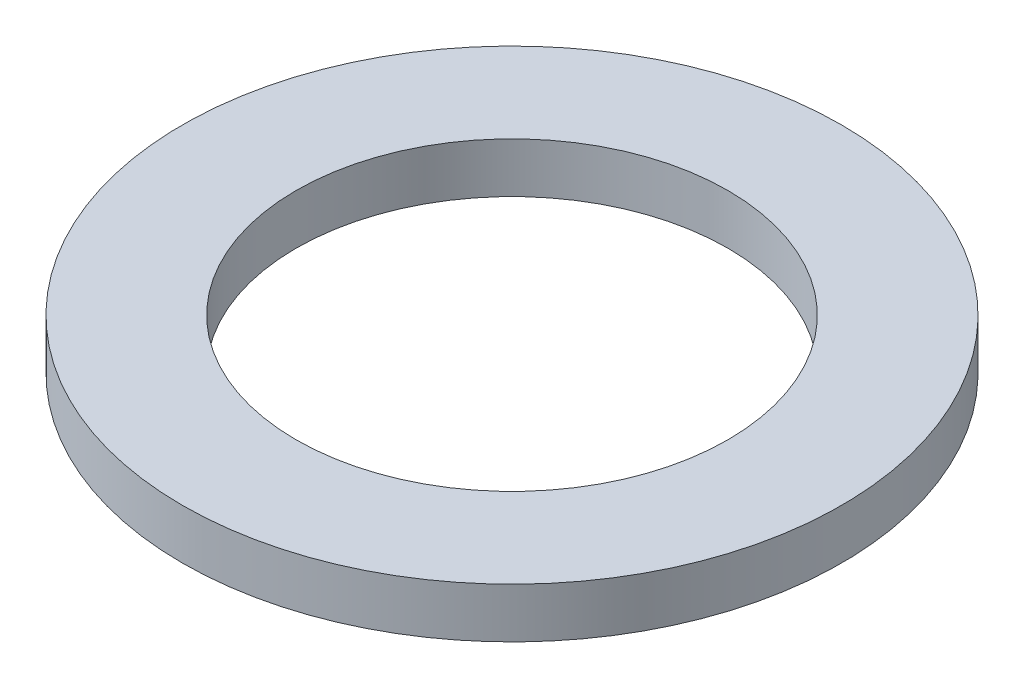
ISO-10303-21;
HEADER;
FILE_DESCRIPTION(('STEP AP214'),'2;1');
FILE_NAME('part.step','',(''),(''),'','','');
FILE_SCHEMA(('AUTOMOTIVE_DESIGN { 1 0 10303 214 1 1 1 1 }'));
ENDSEC;
DATA;
#1=APPLICATION_CONTEXT('core data for automotive mechanical design processes');
#2=APPLICATION_PROTOCOL_DEFINITION('international standard','automotive_design',2000,#1);
#3=PRODUCT_CONTEXT('',#1,'mechanical');
#4=PRODUCT('Part','Part','',(#3));
#5=PRODUCT_RELATED_PRODUCT_CATEGORY('part','',(#4));
#6=PRODUCT_DEFINITION_FORMATION('','',#4);
#7=PRODUCT_DEFINITION_CONTEXT('part definition',#1,'design');
#8=PRODUCT_DEFINITION('design','',#6,#7);
#9=PRODUCT_DEFINITION_SHAPE('','',#8);
#10=(LENGTH_UNIT() NAMED_UNIT(*) SI_UNIT(.MILLI.,.METRE.));
#11=(NAMED_UNIT(*) PLANE_ANGLE_UNIT() SI_UNIT($,.RADIAN.));
#12=(NAMED_UNIT(*) SI_UNIT($,.STERADIAN.) SOLID_ANGLE_UNIT());
#13=UNCERTAINTY_MEASURE_WITH_UNIT(LENGTH_MEASURE(1.E-05),#10,'distance_accuracy_value','');
#14=(GEOMETRIC_REPRESENTATION_CONTEXT(3) GLOBAL_UNCERTAINTY_ASSIGNED_CONTEXT((#13)) GLOBAL_UNIT_ASSIGNED_CONTEXT((#10,
#11,#12)) REPRESENTATION_CONTEXT('',''));
#15=CARTESIAN_POINT('',(0.,0.,0.));
#16=DIRECTION('',(0.,0.,1.));
#17=DIRECTION('',(1.,0.,0.));
#18=AXIS2_PLACEMENT_3D('',#15,#16,#17);
#19=CARTESIAN_POINT('',(0.,11.,0.));
#20=DIRECTION('',(0.,-1.,0.));
#21=DIRECTION('',(0.,0.,-1.));
#22=AXIS2_PLACEMENT_3D('',#19,#20,#21);
#23=CYLINDRICAL_SURFACE('',#22,72.5);
#24=CARTESIAN_POINT('',(0.,11.,0.));
#25=DIRECTION('',(0.,1.,0.));
#26=DIRECTION('',(0.,0.,1.));
#27=AXIS2_PLACEMENT_3D('',#24,#25,#26);
#28=CIRCLE('',#27,72.5);
#29=CARTESIAN_POINT('',(0.,11.,72.5));
#30=VERTEX_POINT('',#29);
#31=EDGE_CURVE('E10',#30,#30,#28,.T.);
#32=ORIENTED_EDGE('',*,*,#31,.F.);
#33=EDGE_LOOP('',(#32));
#34=FACE_BOUND('',#33,.T.);
#35=CARTESIAN_POINT('',(0.,0.,0.));
#36=DIRECTION('',(0.,1.,0.));
#37=DIRECTION('',(0.,0.,1.));
#38=AXIS2_PLACEMENT_3D('',#35,#36,#37);
#39=CIRCLE('',#38,72.5);
#40=CARTESIAN_POINT('',(0.,0.,72.5));
#41=VERTEX_POINT('',#40);
#42=EDGE_CURVE('E37',#41,#41,#39,.T.);
#43=ORIENTED_EDGE('',*,*,#42,.T.);
#44=EDGE_LOOP('',(#43));
#45=FACE_BOUND('',#44,.T.);
#46=ADVANCED_FACE('F40',(#34,#45),#23,.T.);
#47=CARTESIAN_POINT('',(0.,11.,0.));
#48=DIRECTION('',(0.,1.,0.));
#49=DIRECTION('',(0.,0.,1.));
#50=AXIS2_PLACEMENT_3D('',#47,#48,#49);
#51=PLANE('',#50);
#52=CARTESIAN_POINT('',(0.,11.,0.));
#53=DIRECTION('',(0.,1.,0.));
#54=DIRECTION('',(0.,0.,1.));
#55=AXIS2_PLACEMENT_3D('',#52,#53,#54);
#56=CIRCLE('',#55,47.5);
#57=CARTESIAN_POINT('',(0.,11.,47.5));
#58=VERTEX_POINT('',#57);
#59=EDGE_CURVE('E50',#58,#58,#56,.T.);
#60=ORIENTED_EDGE('',*,*,#59,.F.);
#61=EDGE_LOOP('',(#60));
#62=FACE_BOUND('',#61,.T.);
#63=ORIENTED_EDGE('',*,*,#31,.T.);
#64=EDGE_LOOP('',(#63));
#65=FACE_BOUND('',#64,.T.);
#66=ADVANCED_FACE('F59',(#62,#65),#51,.T.);
#67=CARTESIAN_POINT('',(0.,0.,0.));
#68=DIRECTION('',(0.,1.,0.));
#69=DIRECTION('',(0.,0.,1.));
#70=AXIS2_PLACEMENT_3D('',#67,#68,#69);
#71=PLANE('',#70);
#72=CARTESIAN_POINT('',(0.,0.,0.));
#73=DIRECTION('',(0.,1.,0.));
#74=DIRECTION('',(0.,0.,1.));
#75=AXIS2_PLACEMENT_3D('',#72,#73,#74);
#76=CIRCLE('',#75,47.5);
#77=CARTESIAN_POINT('',(0.,0.,47.5));
#78=VERTEX_POINT('',#77);
#79=EDGE_CURVE('E47',#78,#78,#76,.T.);
#80=ORIENTED_EDGE('',*,*,#79,.T.);
#81=EDGE_LOOP('',(#80));
#82=FACE_BOUND('',#81,.T.);
#83=ORIENTED_EDGE('',*,*,#42,.F.);
#84=EDGE_LOOP('',(#83));
#85=FACE_BOUND('',#84,.T.);
#86=ADVANCED_FACE('F58',(#82,#85),#71,.F.);
#87=CARTESIAN_POINT('',(0.,11.,0.));
#88=DIRECTION('',(0.,-1.,0.));
#89=DIRECTION('',(0.,0.,-1.));
#90=AXIS2_PLACEMENT_3D('',#87,#88,#89);
#91=CYLINDRICAL_SURFACE('',#90,47.5);
#92=ORIENTED_EDGE('',*,*,#59,.T.);
#93=EDGE_LOOP('',(#92));
#94=FACE_BOUND('',#93,.T.);
#95=ORIENTED_EDGE('',*,*,#79,.F.);
#96=EDGE_LOOP('',(#95));
#97=FACE_BOUND('',#96,.T.);
#98=ADVANCED_FACE('F54',(#94,#97),#91,.F.);
#99=CLOSED_SHELL('',(#46,#66,#86,#98));
#100=MANIFOLD_SOLID_BREP('B2',#99);
#101=ADVANCED_BREP_SHAPE_REPRESENTATION('',(#18,#100),#14);
#102=SHAPE_DEFINITION_REPRESENTATION(#9,#101);
ENDSEC;
END-ISO-10303-21;
